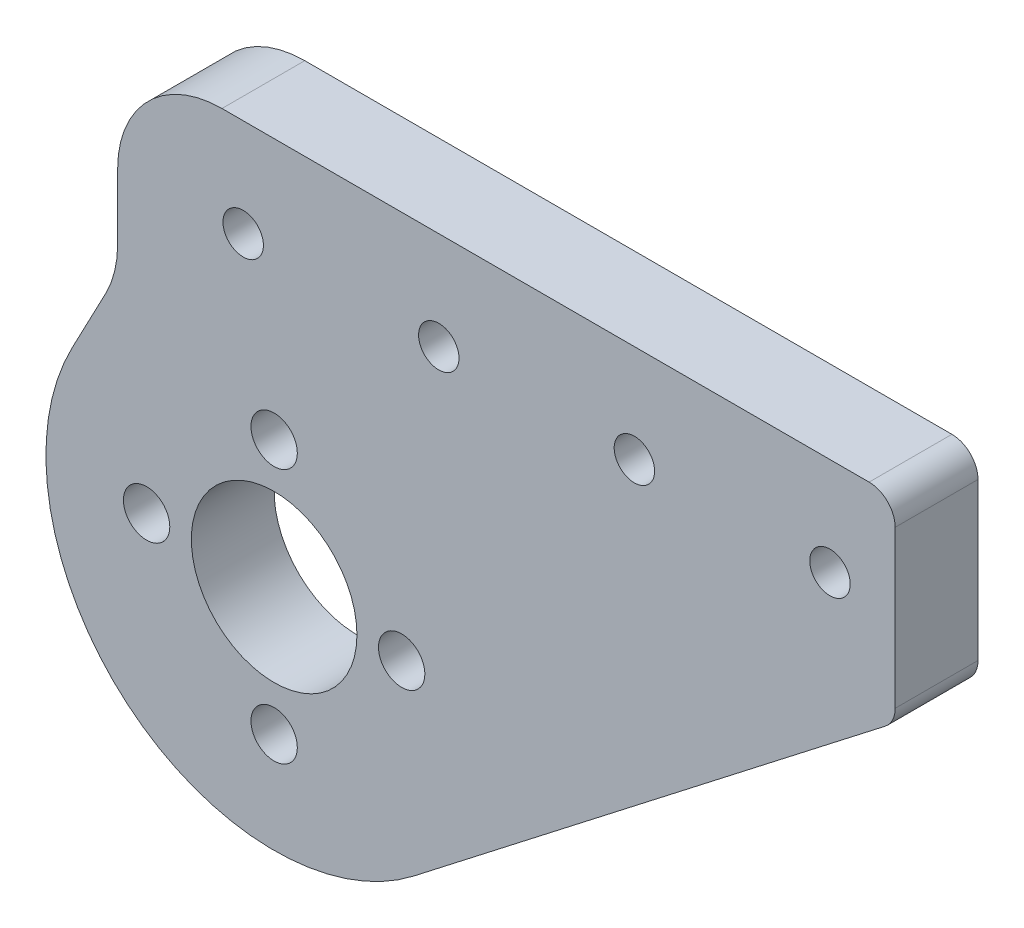
ISO-10303-21;
HEADER;
FILE_DESCRIPTION(('STEP AP214'),'2;1');
FILE_NAME('part.step','',(''),(''),'','','');
FILE_SCHEMA(('AUTOMOTIVE_DESIGN { 1 0 10303 214 1 1 1 1 }'));
ENDSEC;
DATA;
#1=APPLICATION_CONTEXT('core data for automotive mechanical design processes');
#2=APPLICATION_PROTOCOL_DEFINITION('international standard','automotive_design',2000,#1);
#3=PRODUCT_CONTEXT('',#1,'mechanical');
#4=PRODUCT('Part','Part','',(#3));
#5=PRODUCT_RELATED_PRODUCT_CATEGORY('part','',(#4));
#6=PRODUCT_DEFINITION_FORMATION('','',#4);
#7=PRODUCT_DEFINITION_CONTEXT('part definition',#1,'design');
#8=PRODUCT_DEFINITION('design','',#6,#7);
#9=PRODUCT_DEFINITION_SHAPE('','',#8);
#10=(LENGTH_UNIT() NAMED_UNIT(*) SI_UNIT(.MILLI.,.METRE.));
#11=(NAMED_UNIT(*) PLANE_ANGLE_UNIT() SI_UNIT($,.RADIAN.));
#12=(NAMED_UNIT(*) SI_UNIT($,.STERADIAN.) SOLID_ANGLE_UNIT());
#13=UNCERTAINTY_MEASURE_WITH_UNIT(LENGTH_MEASURE(1.E-05),#10,'distance_accuracy_value','');
#14=(GEOMETRIC_REPRESENTATION_CONTEXT(3) GLOBAL_UNCERTAINTY_ASSIGNED_CONTEXT((#13)) GLOBAL_UNIT_ASSIGNED_CONTEXT((#10,
#11,#12)) REPRESENTATION_CONTEXT('',''));
#15=CARTESIAN_POINT('',(0.,0.,0.));
#16=DIRECTION('',(0.,0.,1.));
#17=DIRECTION('',(1.,0.,0.));
#18=AXIS2_PLACEMENT_3D('',#15,#16,#17);
#19=CARTESIAN_POINT('',(-15.4885542715855,8.14583860484291,6.35));
#20=DIRECTION('',(0.885060244090603,-0.465476491705309,0.));
#21=DIRECTION('',(0.465476491705309,0.885060244090603,0.));
#22=AXIS2_PLACEMENT_3D('',#19,#20,#21);
#23=PLANE('',#22);
#24=DIRECTION('',(-0.465476491705309,-0.885060244090603,0.));
#25=VECTOR('',#24,1.);
#26=CARTESIAN_POINT('',(-15.4885542715855,8.14583860484291,6.35));
#27=LINE('',#26,#25);
#28=CARTESIAN_POINT('',(-12.9195180472752,13.0306219790487,6.35));
#29=VERTEX_POINT('',#28);
#30=CARTESIAN_POINT('',(-15.4885542715855,8.14583860484292,6.35));
#31=VERTEX_POINT('',#30);
#32=EDGE_CURVE('E117',#29,#31,#27,.T.);
#33=ORIENTED_EDGE('',*,*,#32,.F.);
#34=DIRECTION('',(0.,0.,-1.));
#35=VECTOR('',#34,1.);
#36=CARTESIAN_POINT('',(-12.9195180472752,13.0306219790487,0.));
#37=LINE('',#36,#35);
#38=CARTESIAN_POINT('',(-12.9195180472752,13.0306219790487,0.));
#39=VERTEX_POINT('',#38);
#40=EDGE_CURVE('E193',#29,#39,#37,.T.);
#41=ORIENTED_EDGE('',*,*,#40,.T.);
#42=DIRECTION('',(-0.465476491705309,-0.885060244090603,0.));
#43=VECTOR('',#42,1.);
#44=CARTESIAN_POINT('',(-15.4885542715855,8.14583860484291,0.));
#45=LINE('',#44,#43);
#46=CARTESIAN_POINT('',(-15.4885542715855,8.14583860484292,0.));
#47=VERTEX_POINT('',#46);
#48=EDGE_CURVE('E142',#39,#47,#45,.T.);
#49=ORIENTED_EDGE('',*,*,#48,.T.);
#50=DIRECTION('',(0.,0.,-1.));
#51=VECTOR('',#50,1.);
#52=CARTESIAN_POINT('',(-15.4885542715855,8.14583860484292,6.35));
#53=LINE('',#52,#51);
#54=EDGE_CURVE('E135',#31,#47,#53,.T.);
#55=ORIENTED_EDGE('',*,*,#54,.F.);
#56=EDGE_LOOP('',(#33,#41,#49,#55));
#57=FACE_BOUND('',#56,.T.);
#58=ADVANCED_FACE('F41',(#57),#23,.F.);
#59=CARTESIAN_POINT('',(0.,0.,6.35));
#60=DIRECTION('',(0.,0.,-1.));
#61=DIRECTION('',(-1.,0.,0.));
#62=AXIS2_PLACEMENT_3D('',#59,#60,#61);
#63=CYLINDRICAL_SURFACE('',#62,17.5);
#64=CARTESIAN_POINT('',(0.,0.,0.));
#65=DIRECTION('',(0.,0.,1.));
#66=DIRECTION('',(1.,0.,0.));
#67=AXIS2_PLACEMENT_3D('',#64,#65,#66);
#68=CIRCLE('',#67,17.5);
#69=CARTESIAN_POINT('',(10.7221171300753,-13.8306255913804,0.));
#70=VERTEX_POINT('',#69);
#71=EDGE_CURVE('E308',#47,#70,#68,.T.);
#72=ORIENTED_EDGE('',*,*,#71,.T.);
#73=DIRECTION('',(0.,0.,-1.));
#74=VECTOR('',#73,1.);
#75=CARTESIAN_POINT('',(10.7221171300753,-13.8306255913804,6.35));
#76=LINE('',#75,#74);
#77=CARTESIAN_POINT('',(10.7221171300753,-13.8306255913804,6.35));
#78=VERTEX_POINT('',#77);
#79=EDGE_CURVE('E137',#78,#70,#76,.T.);
#80=ORIENTED_EDGE('',*,*,#79,.F.);
#81=CARTESIAN_POINT('',(0.,0.,6.35));
#82=DIRECTION('',(0.,0.,1.));
#83=DIRECTION('',(1.,0.,0.));
#84=AXIS2_PLACEMENT_3D('',#81,#82,#83);
#85=CIRCLE('',#84,17.5);
#86=EDGE_CURVE('E122',#31,#78,#85,.T.);
#87=ORIENTED_EDGE('',*,*,#86,.F.);
#88=ORIENTED_EDGE('',*,*,#54,.T.);
#89=EDGE_LOOP('',(#72,#80,#87,#88));
#90=FACE_BOUND('',#89,.T.);
#91=ADVANCED_FACE('F134',(#90),#63,.T.);
#92=CARTESIAN_POINT('',(10.7221171300753,-13.8306255913804,6.35));
#93=DIRECTION('',(0.612692407432875,-0.790321462364593,0.));
#94=DIRECTION('',(0.790321462364593,0.612692407432875,0.));
#95=AXIS2_PLACEMENT_3D('',#92,#93,#94);
#96=PLANE('',#95);
#97=DIRECTION('',(-0.790321462364593,-0.612692407432875,0.));
#98=VECTOR('',#97,1.);
#99=CARTESIAN_POINT('',(10.7221171300753,-13.8306255913804,0.));
#100=LINE('',#99,#98);
#101=CARTESIAN_POINT('',(46.851502811902,14.1784837984104,0.));
#102=VERTEX_POINT('',#101);
#103=EDGE_CURVE('E311',#102,#70,#100,.T.);
#104=ORIENTED_EDGE('',*,*,#103,.F.);
#105=DIRECTION('',(0.,0.,-1.));
#106=VECTOR('',#105,1.);
#107=CARTESIAN_POINT('',(46.851502811902,14.1784837984103,6.35));
#108=LINE('',#107,#106);
#109=CARTESIAN_POINT('',(46.851502811902,14.1784837984104,6.35));
#110=VERTEX_POINT('',#109);
#111=EDGE_CURVE('E164',#102,#110,#108,.F.);
#112=ORIENTED_EDGE('',*,*,#111,.T.);
#113=DIRECTION('',(-0.790321462364593,-0.612692407432875,0.));
#114=VECTOR('',#113,1.);
#115=CARTESIAN_POINT('',(10.7221171300753,-13.8306255913804,6.35));
#116=LINE('',#115,#114);
#117=EDGE_CURVE('E139',#110,#78,#116,.T.);
#118=ORIENTED_EDGE('',*,*,#117,.T.);
#119=ORIENTED_EDGE('',*,*,#79,.T.);
#120=EDGE_LOOP('',(#104,#112,#118,#119));
#121=FACE_BOUND('',#120,.T.);
#122=ADVANCED_FACE('F224',(#121),#96,.T.);
#123=CARTESIAN_POINT('',(47.6261179970363,0.,6.35));
#124=DIRECTION('',(-1.,0.,0.));
#125=DIRECTION('',(0.,-1.,0.));
#126=AXIS2_PLACEMENT_3D('',#123,#124,#125);
#127=PLANE('',#126);
#128=DIRECTION('',(0.,1.,0.));
#129=VECTOR('',#128,1.);
#130=CARTESIAN_POINT('',(47.6261179970363,0.,6.35));
#131=LINE('',#130,#129);
#132=CARTESIAN_POINT('',(47.6261179970363,15.7591267231395,6.35));
#133=VERTEX_POINT('',#132);
#134=CARTESIAN_POINT('',(47.6261179970363,27.779,6.35));
#135=VERTEX_POINT('',#134);
#136=EDGE_CURVE('E257',#133,#135,#131,.T.);
#137=ORIENTED_EDGE('',*,*,#136,.F.);
#138=DIRECTION('',(0.,0.,-1.));
#139=VECTOR('',#138,1.);
#140=CARTESIAN_POINT('',(47.6261179970363,15.7591267231395,0.));
#141=LINE('',#140,#139);
#142=CARTESIAN_POINT('',(47.6261179970363,15.7591267231395,0.));
#143=VERTEX_POINT('',#142);
#144=EDGE_CURVE('E149',#133,#143,#141,.T.);
#145=ORIENTED_EDGE('',*,*,#144,.T.);
#146=DIRECTION('',(0.,1.,0.));
#147=VECTOR('',#146,1.);
#148=CARTESIAN_POINT('',(47.6261179970363,0.,0.));
#149=LINE('',#148,#147);
#150=CARTESIAN_POINT('',(47.6261179970363,27.779,0.));
#151=VERTEX_POINT('',#150);
#152=EDGE_CURVE('E314',#143,#151,#149,.T.);
#153=ORIENTED_EDGE('',*,*,#152,.T.);
#154=DIRECTION('',(0.,0.,-1.));
#155=VECTOR('',#154,1.);
#156=CARTESIAN_POINT('',(47.6261179970363,27.779,6.35));
#157=LINE('',#156,#155);
#158=EDGE_CURVE('E145',#151,#135,#157,.F.);
#159=ORIENTED_EDGE('',*,*,#158,.T.);
#160=EDGE_LOOP('',(#137,#145,#153,#159));
#161=FACE_BOUND('',#160,.T.);
#162=ADVANCED_FACE('F396',(#161),#127,.F.);
#163=CARTESIAN_POINT('',(0.,29.779,6.35));
#164=DIRECTION('',(0.,1.,0.));
#165=DIRECTION('',(0.,0.,1.));
#166=AXIS2_PLACEMENT_3D('',#163,#164,#165);
#167=PLANE('',#166);
#168=DIRECTION('',(1.,0.,0.));
#169=VECTOR('',#168,1.);
#170=CARTESIAN_POINT('',(0.,29.779,0.));
#171=LINE('',#170,#169);
#172=CARTESIAN_POINT('',(-4.,29.779,0.));
#173=VERTEX_POINT('',#172);
#174=CARTESIAN_POINT('',(45.6261179970363,29.779,0.));
#175=VERTEX_POINT('',#174);
#176=EDGE_CURVE('E210',#173,#175,#171,.T.);
#177=ORIENTED_EDGE('',*,*,#176,.F.);
#178=DIRECTION('',(0.,0.,-1.));
#179=VECTOR('',#178,1.);
#180=CARTESIAN_POINT('',(-4.,29.779,6.35));
#181=LINE('',#180,#179);
#182=CARTESIAN_POINT('',(-4.,29.779,6.35));
#183=VERTEX_POINT('',#182);
#184=EDGE_CURVE('E63',#173,#183,#181,.F.);
#185=ORIENTED_EDGE('',*,*,#184,.T.);
#186=DIRECTION('',(1.,0.,0.));
#187=VECTOR('',#186,1.);
#188=CARTESIAN_POINT('',(0.,29.779,6.35));
#189=LINE('',#188,#187);
#190=CARTESIAN_POINT('',(45.6261179970363,29.779,6.35));
#191=VERTEX_POINT('',#190);
#192=EDGE_CURVE('E254',#183,#191,#189,.T.);
#193=ORIENTED_EDGE('',*,*,#192,.T.);
#194=DIRECTION('',(0.,0.,-1.));
#195=VECTOR('',#194,1.);
#196=CARTESIAN_POINT('',(45.6261179970363,29.779,0.));
#197=LINE('',#196,#195);
#198=EDGE_CURVE('E174',#191,#175,#197,.T.);
#199=ORIENTED_EDGE('',*,*,#198,.T.);
#200=EDGE_LOOP('',(#177,#185,#193,#199));
#201=FACE_BOUND('',#200,.T.);
#202=ADVANCED_FACE('F375',(#201),#167,.T.);
#203=CARTESIAN_POINT('',(0.,-9.779,6.35));
#204=DIRECTION('',(0.,0.,-1.));
#205=DIRECTION('',(-1.,0.,0.));
#206=AXIS2_PLACEMENT_3D('',#203,#204,#205);
#207=CYLINDRICAL_SURFACE('',#206,1.778);
#208=CARTESIAN_POINT('',(0.,-9.779,6.35));
#209=DIRECTION('',(0.,0.,1.));
#210=DIRECTION('',(1.,0.,0.));
#211=AXIS2_PLACEMENT_3D('',#208,#209,#210);
#212=CIRCLE('',#211,1.778);
#213=CARTESIAN_POINT('',(1.77799999999993,-9.779,6.35));
#214=VERTEX_POINT('',#213);
#215=EDGE_CURVE('E287',#214,#214,#212,.T.);
#216=ORIENTED_EDGE('',*,*,#215,.T.);
#217=EDGE_LOOP('',(#216));
#218=FACE_BOUND('',#217,.T.);
#219=CARTESIAN_POINT('',(0.,-9.779,0.));
#220=DIRECTION('',(0.,0.,1.));
#221=DIRECTION('',(1.,0.,0.));
#222=AXIS2_PLACEMENT_3D('',#219,#220,#221);
#223=CIRCLE('',#222,1.778);
#224=CARTESIAN_POINT('',(1.77799999999993,-9.779,0.));
#225=VERTEX_POINT('',#224);
#226=EDGE_CURVE('E335',#225,#225,#223,.T.);
#227=ORIENTED_EDGE('',*,*,#226,.F.);
#228=EDGE_LOOP('',(#227));
#229=FACE_BOUND('',#228,.T.);
#230=ADVANCED_FACE('F371',(#218,#229),#207,.F.);
#231=CARTESIAN_POINT('',(42.6261179970363,22.279,6.35));
#232=DIRECTION('',(0.,0.,-1.));
#233=DIRECTION('',(-1.,0.,0.));
#234=AXIS2_PLACEMENT_3D('',#231,#232,#233);
#235=CYLINDRICAL_SURFACE('',#234,1.55);
#236=CARTESIAN_POINT('',(42.6261179970363,22.279,6.35));
#237=DIRECTION('',(0.,0.,1.));
#238=DIRECTION('',(1.,0.,0.));
#239=AXIS2_PLACEMENT_3D('',#236,#237,#238);
#240=CIRCLE('',#239,1.55);
#241=CARTESIAN_POINT('',(44.1761179970363,22.279,6.35));
#242=VERTEX_POINT('',#241);
#243=EDGE_CURVE('E283',#242,#242,#240,.T.);
#244=ORIENTED_EDGE('',*,*,#243,.T.);
#245=EDGE_LOOP('',(#244));
#246=FACE_BOUND('',#245,.T.);
#247=CARTESIAN_POINT('',(42.6261179970363,22.279,0.));
#248=DIRECTION('',(0.,0.,1.));
#249=DIRECTION('',(1.,0.,0.));
#250=AXIS2_PLACEMENT_3D('',#247,#248,#249);
#251=CIRCLE('',#250,1.55);
#252=CARTESIAN_POINT('',(44.1761179970363,22.279,0.));
#253=VERTEX_POINT('',#252);
#254=EDGE_CURVE('E331',#253,#253,#251,.T.);
#255=ORIENTED_EDGE('',*,*,#254,.F.);
#256=EDGE_LOOP('',(#255));
#257=FACE_BOUND('',#256,.T.);
#258=ADVANCED_FACE('F374',(#246,#257),#235,.F.);
#259=CARTESIAN_POINT('',(27.6261179970363,22.279,6.35));
#260=DIRECTION('',(0.,0.,-1.));
#261=DIRECTION('',(-1.,0.,0.));
#262=AXIS2_PLACEMENT_3D('',#259,#260,#261);
#263=CYLINDRICAL_SURFACE('',#262,1.55);
#264=CARTESIAN_POINT('',(27.6261179970363,22.279,6.35));
#265=DIRECTION('',(0.,0.,1.));
#266=DIRECTION('',(1.,0.,0.));
#267=AXIS2_PLACEMENT_3D('',#264,#265,#266);
#268=CIRCLE('',#267,1.55);
#269=CARTESIAN_POINT('',(29.1761179970363,22.279,6.35));
#270=VERTEX_POINT('',#269);
#271=EDGE_CURVE('E279',#270,#270,#268,.T.);
#272=ORIENTED_EDGE('',*,*,#271,.T.);
#273=EDGE_LOOP('',(#272));
#274=FACE_BOUND('',#273,.T.);
#275=CARTESIAN_POINT('',(27.6261179970363,22.279,0.));
#276=DIRECTION('',(0.,0.,1.));
#277=DIRECTION('',(1.,0.,0.));
#278=AXIS2_PLACEMENT_3D('',#275,#276,#277);
#279=CIRCLE('',#278,1.55);
#280=CARTESIAN_POINT('',(29.1761179970363,22.279,0.));
#281=VERTEX_POINT('',#280);
#282=EDGE_CURVE('E327',#281,#281,#279,.T.);
#283=ORIENTED_EDGE('',*,*,#282,.F.);
#284=EDGE_LOOP('',(#283));
#285=FACE_BOUND('',#284,.T.);
#286=ADVANCED_FACE('F379',(#274,#285),#263,.F.);
#287=CARTESIAN_POINT('',(12.6261179970363,22.279,6.35));
#288=DIRECTION('',(0.,0.,-1.));
#289=DIRECTION('',(-1.,0.,0.));
#290=AXIS2_PLACEMENT_3D('',#287,#288,#289);
#291=CYLINDRICAL_SURFACE('',#290,1.55);
#292=CARTESIAN_POINT('',(12.6261179970363,22.279,6.35));
#293=DIRECTION('',(0.,0.,1.));
#294=DIRECTION('',(1.,0.,0.));
#295=AXIS2_PLACEMENT_3D('',#292,#293,#294);
#296=CIRCLE('',#295,1.55);
#297=CARTESIAN_POINT('',(14.1761179970363,22.279,6.35));
#298=VERTEX_POINT('',#297);
#299=EDGE_CURVE('E275',#298,#298,#296,.T.);
#300=ORIENTED_EDGE('',*,*,#299,.T.);
#301=EDGE_LOOP('',(#300));
#302=FACE_BOUND('',#301,.T.);
#303=CARTESIAN_POINT('',(12.6261179970363,22.279,0.));
#304=DIRECTION('',(0.,0.,1.));
#305=DIRECTION('',(1.,0.,0.));
#306=AXIS2_PLACEMENT_3D('',#303,#304,#305);
#307=CIRCLE('',#306,1.55);
#308=CARTESIAN_POINT('',(14.1761179970363,22.279,0.));
#309=VERTEX_POINT('',#308);
#310=EDGE_CURVE('E323',#309,#309,#307,.T.);
#311=ORIENTED_EDGE('',*,*,#310,.F.);
#312=EDGE_LOOP('',(#311));
#313=FACE_BOUND('',#312,.T.);
#314=ADVANCED_FACE('F383',(#302,#313),#291,.F.);
#315=CARTESIAN_POINT('',(-2.37388200296373,22.279,6.35));
#316=DIRECTION('',(0.,0.,-1.));
#317=DIRECTION('',(-1.,0.,0.));
#318=AXIS2_PLACEMENT_3D('',#315,#316,#317);
#319=CYLINDRICAL_SURFACE('',#318,1.55);
#320=CARTESIAN_POINT('',(-2.37388200296373,22.279,6.35));
#321=DIRECTION('',(0.,0.,1.));
#322=DIRECTION('',(1.,0.,0.));
#323=AXIS2_PLACEMENT_3D('',#320,#321,#322);
#324=CIRCLE('',#323,1.55);
#325=CARTESIAN_POINT('',(-0.823882002963734,22.279,6.35));
#326=VERTEX_POINT('',#325);
#327=EDGE_CURVE('E271',#326,#326,#324,.T.);
#328=ORIENTED_EDGE('',*,*,#327,.T.);
#329=EDGE_LOOP('',(#328));
#330=FACE_BOUND('',#329,.T.);
#331=CARTESIAN_POINT('',(-2.37388200296373,22.279,0.));
#332=DIRECTION('',(0.,0.,1.));
#333=DIRECTION('',(1.,0.,0.));
#334=AXIS2_PLACEMENT_3D('',#331,#332,#333);
#335=CIRCLE('',#334,1.55);
#336=CARTESIAN_POINT('',(-0.823882002963734,22.279,0.));
#337=VERTEX_POINT('',#336);
#338=EDGE_CURVE('E209',#337,#337,#335,.T.);
#339=ORIENTED_EDGE('',*,*,#338,.F.);
#340=EDGE_LOOP('',(#339));
#341=FACE_BOUND('',#340,.T.);
#342=ADVANCED_FACE('F387',(#330,#341),#319,.F.);
#343=CARTESIAN_POINT('',(-12.,0.,6.35));
#344=DIRECTION('',(1.,0.,0.));
#345=DIRECTION('',(0.,1.,0.));
#346=AXIS2_PLACEMENT_3D('',#343,#344,#345);
#347=PLANE('',#346);
#348=DIRECTION('',(0.,-1.,0.));
#349=VECTOR('',#348,1.);
#350=CARTESIAN_POINT('',(-12.,0.,6.35));
#351=LINE('',#350,#349);
#352=CARTESIAN_POINT('',(-12.,21.779,6.35));
#353=VERTEX_POINT('',#352);
#354=CARTESIAN_POINT('',(-12.,16.7544339126912,6.35));
#355=VERTEX_POINT('',#354);
#356=EDGE_CURVE('E265',#353,#355,#351,.T.);
#357=ORIENTED_EDGE('',*,*,#356,.F.);
#358=DIRECTION('',(0.,0.,-1.));
#359=VECTOR('',#358,1.);
#360=CARTESIAN_POINT('',(-12.,21.779,0.));
#361=LINE('',#360,#359);
#362=CARTESIAN_POINT('',(-12.,21.779,0.));
#363=VERTEX_POINT('',#362);
#364=EDGE_CURVE('E181',#353,#363,#361,.T.);
#365=ORIENTED_EDGE('',*,*,#364,.T.);
#366=DIRECTION('',(0.,-1.,0.));
#367=VECTOR('',#366,1.);
#368=CARTESIAN_POINT('',(-12.,0.,0.));
#369=LINE('',#368,#367);
#370=CARTESIAN_POINT('',(-12.,16.7544339126912,0.));
#371=VERTEX_POINT('',#370);
#372=EDGE_CURVE('E201',#363,#371,#369,.T.);
#373=ORIENTED_EDGE('',*,*,#372,.T.);
#374=DIRECTION('',(0.,0.,-1.));
#375=VECTOR('',#374,1.);
#376=CARTESIAN_POINT('',(-12.,16.7544339126912,6.35));
#377=LINE('',#376,#375);
#378=EDGE_CURVE('E178',#371,#355,#377,.F.);
#379=ORIENTED_EDGE('',*,*,#378,.T.);
#380=EDGE_LOOP('',(#357,#365,#373,#379));
#381=FACE_BOUND('',#380,.T.);
#382=ADVANCED_FACE('F206',(#381),#347,.F.);
#383=CARTESIAN_POINT('',(9.779,0.,6.35));
#384=DIRECTION('',(0.,0.,-1.));
#385=DIRECTION('',(-1.,0.,0.));
#386=AXIS2_PLACEMENT_3D('',#383,#384,#385);
#387=CYLINDRICAL_SURFACE('',#386,1.778);
#388=CARTESIAN_POINT('',(9.779,0.,6.35));
#389=DIRECTION('',(0.,0.,1.));
#390=DIRECTION('',(1.,0.,0.));
#391=AXIS2_PLACEMENT_3D('',#388,#389,#390);
#392=CIRCLE('',#391,1.778);
#393=CARTESIAN_POINT('',(11.557,0.,6.35));
#394=VERTEX_POINT('',#393);
#395=EDGE_CURVE('E129',#394,#394,#392,.T.);
#396=ORIENTED_EDGE('',*,*,#395,.T.);
#397=EDGE_LOOP('',(#396));
#398=FACE_BOUND('',#397,.T.);
#399=CARTESIAN_POINT('',(9.779,0.,0.));
#400=DIRECTION('',(0.,0.,1.));
#401=DIRECTION('',(1.,0.,0.));
#402=AXIS2_PLACEMENT_3D('',#399,#400,#401);
#403=CIRCLE('',#402,1.778);
#404=CARTESIAN_POINT('',(11.557,0.,0.));
#405=VERTEX_POINT('',#404);
#406=EDGE_CURVE('E302',#405,#405,#403,.T.);
#407=ORIENTED_EDGE('',*,*,#406,.F.);
#408=EDGE_LOOP('',(#407));
#409=FACE_BOUND('',#408,.T.);
#410=ADVANCED_FACE('F228',(#398,#409),#387,.F.);
#411=CARTESIAN_POINT('',(0.,9.779,6.35));
#412=DIRECTION('',(0.,0.,-1.));
#413=DIRECTION('',(-1.,0.,0.));
#414=AXIS2_PLACEMENT_3D('',#411,#412,#413);
#415=CYLINDRICAL_SURFACE('',#414,1.778);
#416=CARTESIAN_POINT('',(0.,9.779,6.35));
#417=DIRECTION('',(0.,0.,1.));
#418=DIRECTION('',(1.,0.,0.));
#419=AXIS2_PLACEMENT_3D('',#416,#417,#418);
#420=CIRCLE('',#419,1.778);
#421=CARTESIAN_POINT('',(1.778,9.779,6.35));
#422=VERTEX_POINT('',#421);
#423=EDGE_CURVE('E346',#422,#422,#420,.T.);
#424=ORIENTED_EDGE('',*,*,#423,.T.);
#425=EDGE_LOOP('',(#424));
#426=FACE_BOUND('',#425,.T.);
#427=CARTESIAN_POINT('',(0.,9.779,0.));
#428=DIRECTION('',(0.,0.,1.));
#429=DIRECTION('',(1.,0.,0.));
#430=AXIS2_PLACEMENT_3D('',#427,#428,#429);
#431=CIRCLE('',#430,1.778);
#432=CARTESIAN_POINT('',(1.778,9.779,0.));
#433=VERTEX_POINT('',#432);
#434=EDGE_CURVE('E298',#433,#433,#431,.T.);
#435=ORIENTED_EDGE('',*,*,#434,.F.);
#436=EDGE_LOOP('',(#435));
#437=FACE_BOUND('',#436,.T.);
#438=ADVANCED_FACE('F231',(#426,#437),#415,.F.);
#439=CARTESIAN_POINT('',(-9.779,1.02429588037641E-13,6.35));
#440=DIRECTION('',(0.,0.,-1.));
#441=DIRECTION('',(-1.,0.,0.));
#442=AXIS2_PLACEMENT_3D('',#439,#440,#441);
#443=CYLINDRICAL_SURFACE('',#442,1.778);
#444=CARTESIAN_POINT('',(-9.779,1.02429588037641E-13,6.35));
#445=DIRECTION('',(0.,0.,1.));
#446=DIRECTION('',(1.,0.,0.));
#447=AXIS2_PLACEMENT_3D('',#444,#445,#446);
#448=CIRCLE('',#447,1.778);
#449=CARTESIAN_POINT('',(-8.001,1.02429588037641E-13,6.35));
#450=VERTEX_POINT('',#449);
#451=EDGE_CURVE('E341',#450,#450,#448,.T.);
#452=ORIENTED_EDGE('',*,*,#451,.T.);
#453=EDGE_LOOP('',(#452));
#454=FACE_BOUND('',#453,.T.);
#455=CARTESIAN_POINT('',(-9.779,1.02429588037641E-13,0.));
#456=DIRECTION('',(0.,0.,1.));
#457=DIRECTION('',(1.,0.,0.));
#458=AXIS2_PLACEMENT_3D('',#455,#456,#457);
#459=CIRCLE('',#458,1.778);
#460=CARTESIAN_POINT('',(-8.001,1.02429588037641E-13,0.));
#461=VERTEX_POINT('',#460);
#462=EDGE_CURVE('E294',#461,#461,#459,.T.);
#463=ORIENTED_EDGE('',*,*,#462,.F.);
#464=EDGE_LOOP('',(#463));
#465=FACE_BOUND('',#464,.T.);
#466=ADVANCED_FACE('F235',(#454,#465),#443,.F.);
#467=CARTESIAN_POINT('',(0.,0.,6.35));
#468=DIRECTION('',(0.,0.,-1.));
#469=DIRECTION('',(-1.,0.,0.));
#470=AXIS2_PLACEMENT_3D('',#467,#468,#469);
#471=CYLINDRICAL_SURFACE('',#470,6.35);
#472=CARTESIAN_POINT('',(0.,0.,6.35));
#473=DIRECTION('',(0.,0.,1.));
#474=DIRECTION('',(1.,0.,0.));
#475=AXIS2_PLACEMENT_3D('',#472,#473,#474);
#476=CIRCLE('',#475,6.35);
#477=CARTESIAN_POINT('',(6.35,0.,6.35));
#478=VERTEX_POINT('',#477);
#479=EDGE_CURVE('E151',#478,#478,#476,.T.);
#480=ORIENTED_EDGE('',*,*,#479,.T.);
#481=EDGE_LOOP('',(#480));
#482=FACE_BOUND('',#481,.T.);
#483=CARTESIAN_POINT('',(0.,0.,0.));
#484=DIRECTION('',(0.,0.,1.));
#485=DIRECTION('',(1.,0.,0.));
#486=AXIS2_PLACEMENT_3D('',#483,#484,#485);
#487=CIRCLE('',#486,6.35);
#488=CARTESIAN_POINT('',(6.35,0.,0.));
#489=VERTEX_POINT('',#488);
#490=EDGE_CURVE('E338',#489,#489,#487,.T.);
#491=ORIENTED_EDGE('',*,*,#490,.F.);
#492=EDGE_LOOP('',(#491));
#493=FACE_BOUND('',#492,.T.);
#494=ADVANCED_FACE('F239',(#482,#493),#471,.F.);
#495=CARTESIAN_POINT('',(0.,0.,6.35));
#496=DIRECTION('',(0.,0.,1.));
#497=DIRECTION('',(1.,0.,0.));
#498=AXIS2_PLACEMENT_3D('',#495,#496,#497);
#499=PLANE('',#498);
#500=ORIENTED_EDGE('',*,*,#451,.F.);
#501=EDGE_LOOP('',(#500));
#502=FACE_BOUND('',#501,.T.);
#503=ORIENTED_EDGE('',*,*,#423,.F.);
#504=EDGE_LOOP('',(#503));
#505=FACE_BOUND('',#504,.T.);
#506=ORIENTED_EDGE('',*,*,#395,.F.);
#507=EDGE_LOOP('',(#506));
#508=FACE_BOUND('',#507,.T.);
#509=ORIENTED_EDGE('',*,*,#192,.F.);
#510=CARTESIAN_POINT('',(-4.,21.779,6.35));
#511=DIRECTION('',(0.,0.,1.));
#512=DIRECTION('',(1.,0.,0.));
#513=AXIS2_PLACEMENT_3D('',#510,#511,#512);
#514=CIRCLE('',#513,8.);
#515=EDGE_CURVE('E190',#183,#353,#514,.T.);
#516=ORIENTED_EDGE('',*,*,#515,.T.);
#517=ORIENTED_EDGE('',*,*,#356,.T.);
#518=CARTESIAN_POINT('',(-20.,16.7544339126912,6.35));
#519=DIRECTION('',(0.,0.,1.));
#520=DIRECTION('',(1.,0.,0.));
#521=AXIS2_PLACEMENT_3D('',#518,#519,#520);
#522=CIRCLE('',#521,8.);
#523=EDGE_CURVE('E11',#355,#29,#522,.F.);
#524=ORIENTED_EDGE('',*,*,#523,.T.);
#525=ORIENTED_EDGE('',*,*,#32,.T.);
#526=ORIENTED_EDGE('',*,*,#86,.T.);
#527=ORIENTED_EDGE('',*,*,#117,.F.);
#528=CARTESIAN_POINT('',(45.6261179970363,15.7591267231395,6.35));
#529=DIRECTION('',(0.,0.,1.));
#530=DIRECTION('',(1.,0.,0.));
#531=AXIS2_PLACEMENT_3D('',#528,#529,#530);
#532=CIRCLE('',#531,2.);
#533=EDGE_CURVE('E171',#110,#133,#532,.T.);
#534=ORIENTED_EDGE('',*,*,#533,.T.);
#535=ORIENTED_EDGE('',*,*,#136,.T.);
#536=CARTESIAN_POINT('',(45.6261179970363,27.779,6.35));
#537=DIRECTION('',(0.,0.,1.));
#538=DIRECTION('',(1.,0.,0.));
#539=AXIS2_PLACEMENT_3D('',#536,#537,#538);
#540=CIRCLE('',#539,2.);
#541=EDGE_CURVE('E167',#135,#191,#540,.T.);
#542=ORIENTED_EDGE('',*,*,#541,.T.);
#543=EDGE_LOOP('',(#509,#516,#517,#524,#525,#526,#527,#534,#535,#542));
#544=FACE_BOUND('',#543,.T.);
#545=ORIENTED_EDGE('',*,*,#327,.F.);
#546=EDGE_LOOP('',(#545));
#547=FACE_BOUND('',#546,.T.);
#548=ORIENTED_EDGE('',*,*,#299,.F.);
#549=EDGE_LOOP('',(#548));
#550=FACE_BOUND('',#549,.T.);
#551=ORIENTED_EDGE('',*,*,#271,.F.);
#552=EDGE_LOOP('',(#551));
#553=FACE_BOUND('',#552,.T.);
#554=ORIENTED_EDGE('',*,*,#243,.F.);
#555=EDGE_LOOP('',(#554));
#556=FACE_BOUND('',#555,.T.);
#557=ORIENTED_EDGE('',*,*,#215,.F.);
#558=EDGE_LOOP('',(#557));
#559=FACE_BOUND('',#558,.T.);
#560=ORIENTED_EDGE('',*,*,#479,.F.);
#561=EDGE_LOOP('',(#560));
#562=FACE_BOUND('',#561,.T.);
#563=ADVANCED_FACE('F119',(#502,#505,#508,#544,#547,#550,#553,#556,#559,#562),#499,.T.);
#564=CARTESIAN_POINT('',(0.,0.,0.));
#565=DIRECTION('',(0.,0.,1.));
#566=DIRECTION('',(1.,0.,0.));
#567=AXIS2_PLACEMENT_3D('',#564,#565,#566);
#568=PLANE('',#567);
#569=ORIENTED_EDGE('',*,*,#462,.T.);
#570=EDGE_LOOP('',(#569));
#571=FACE_BOUND('',#570,.T.);
#572=ORIENTED_EDGE('',*,*,#434,.T.);
#573=EDGE_LOOP('',(#572));
#574=FACE_BOUND('',#573,.T.);
#575=ORIENTED_EDGE('',*,*,#406,.T.);
#576=EDGE_LOOP('',(#575));
#577=FACE_BOUND('',#576,.T.);
#578=ORIENTED_EDGE('',*,*,#372,.F.);
#579=CARTESIAN_POINT('',(-4.,21.779,0.));
#580=DIRECTION('',(0.,0.,1.));
#581=DIRECTION('',(1.,0.,0.));
#582=AXIS2_PLACEMENT_3D('',#579,#580,#581);
#583=CIRCLE('',#582,8.);
#584=EDGE_CURVE('E185',#363,#173,#583,.F.);
#585=ORIENTED_EDGE('',*,*,#584,.T.);
#586=ORIENTED_EDGE('',*,*,#176,.T.);
#587=CARTESIAN_POINT('',(45.6261179970363,27.779,0.));
#588=DIRECTION('',(0.,0.,1.));
#589=DIRECTION('',(1.,0.,0.));
#590=AXIS2_PLACEMENT_3D('',#587,#588,#589);
#591=CIRCLE('',#590,2.);
#592=EDGE_CURVE('E158',#175,#151,#591,.F.);
#593=ORIENTED_EDGE('',*,*,#592,.T.);
#594=ORIENTED_EDGE('',*,*,#152,.F.);
#595=CARTESIAN_POINT('',(45.6261179970363,15.7591267231395,0.));
#596=DIRECTION('',(0.,0.,1.));
#597=DIRECTION('',(1.,0.,0.));
#598=AXIS2_PLACEMENT_3D('',#595,#596,#597);
#599=CIRCLE('',#598,2.);
#600=EDGE_CURVE('E161',#143,#102,#599,.F.);
#601=ORIENTED_EDGE('',*,*,#600,.T.);
#602=ORIENTED_EDGE('',*,*,#103,.T.);
#603=ORIENTED_EDGE('',*,*,#71,.F.);
#604=ORIENTED_EDGE('',*,*,#48,.F.);
#605=CARTESIAN_POINT('',(-20.,16.7544339126912,0.));
#606=DIRECTION('',(0.,0.,1.));
#607=DIRECTION('',(1.,0.,0.));
#608=AXIS2_PLACEMENT_3D('',#605,#606,#607);
#609=CIRCLE('',#608,8.);
#610=EDGE_CURVE('E50',#39,#371,#609,.T.);
#611=ORIENTED_EDGE('',*,*,#610,.T.);
#612=EDGE_LOOP('',(#578,#585,#586,#593,#594,#601,#602,#603,#604,#611));
#613=FACE_BOUND('',#612,.T.);
#614=ORIENTED_EDGE('',*,*,#338,.T.);
#615=EDGE_LOOP('',(#614));
#616=FACE_BOUND('',#615,.T.);
#617=ORIENTED_EDGE('',*,*,#310,.T.);
#618=EDGE_LOOP('',(#617));
#619=FACE_BOUND('',#618,.T.);
#620=ORIENTED_EDGE('',*,*,#282,.T.);
#621=EDGE_LOOP('',(#620));
#622=FACE_BOUND('',#621,.T.);
#623=ORIENTED_EDGE('',*,*,#254,.T.);
#624=EDGE_LOOP('',(#623));
#625=FACE_BOUND('',#624,.T.);
#626=ORIENTED_EDGE('',*,*,#226,.T.);
#627=EDGE_LOOP('',(#626));
#628=FACE_BOUND('',#627,.T.);
#629=ORIENTED_EDGE('',*,*,#490,.T.);
#630=EDGE_LOOP('',(#629));
#631=FACE_BOUND('',#630,.T.);
#632=ADVANCED_FACE('F199',(#571,#574,#577,#613,#616,#619,#622,#625,#628,#631),#568,.F.);
#633=CARTESIAN_POINT('',(45.6261179970363,15.7591267231395,6.35));
#634=DIRECTION('',(0.,0.,1.));
#635=DIRECTION('',(1.,0.,0.));
#636=AXIS2_PLACEMENT_3D('',#633,#634,#635);
#637=CYLINDRICAL_SURFACE('',#636,2.);
#638=ORIENTED_EDGE('',*,*,#533,.F.);
#639=ORIENTED_EDGE('',*,*,#111,.F.);
#640=ORIENTED_EDGE('',*,*,#600,.F.);
#641=ORIENTED_EDGE('',*,*,#144,.F.);
#642=EDGE_LOOP('',(#638,#639,#640,#641));
#643=FACE_BOUND('',#642,.T.);
#644=ADVANCED_FACE('F241',(#643),#637,.T.);
#645=CARTESIAN_POINT('',(45.6261179970363,27.779,6.35));
#646=DIRECTION('',(0.,0.,1.));
#647=DIRECTION('',(1.,0.,0.));
#648=AXIS2_PLACEMENT_3D('',#645,#646,#647);
#649=CYLINDRICAL_SURFACE('',#648,2.);
#650=ORIENTED_EDGE('',*,*,#541,.F.);
#651=ORIENTED_EDGE('',*,*,#158,.F.);
#652=ORIENTED_EDGE('',*,*,#592,.F.);
#653=ORIENTED_EDGE('',*,*,#198,.F.);
#654=EDGE_LOOP('',(#650,#651,#652,#653));
#655=FACE_BOUND('',#654,.T.);
#656=ADVANCED_FACE('F217',(#655),#649,.T.);
#657=CARTESIAN_POINT('',(-4.,21.779,6.35));
#658=DIRECTION('',(0.,0.,1.));
#659=DIRECTION('',(1.,0.,0.));
#660=AXIS2_PLACEMENT_3D('',#657,#658,#659);
#661=CYLINDRICAL_SURFACE('',#660,8.);
#662=ORIENTED_EDGE('',*,*,#515,.F.);
#663=ORIENTED_EDGE('',*,*,#184,.F.);
#664=ORIENTED_EDGE('',*,*,#584,.F.);
#665=ORIENTED_EDGE('',*,*,#364,.F.);
#666=EDGE_LOOP('',(#662,#663,#664,#665));
#667=FACE_BOUND('',#666,.T.);
#668=ADVANCED_FACE('F213',(#667),#661,.T.);
#669=CARTESIAN_POINT('',(-20.,16.7544339126912,6.35));
#670=DIRECTION('',(0.,0.,1.));
#671=DIRECTION('',(1.,0.,0.));
#672=AXIS2_PLACEMENT_3D('',#669,#670,#671);
#673=CYLINDRICAL_SURFACE('',#672,8.);
#674=ORIENTED_EDGE('',*,*,#523,.F.);
#675=ORIENTED_EDGE('',*,*,#378,.F.);
#676=ORIENTED_EDGE('',*,*,#610,.F.);
#677=ORIENTED_EDGE('',*,*,#40,.F.);
#678=EDGE_LOOP('',(#674,#675,#676,#677));
#679=FACE_BOUND('',#678,.T.);
#680=ADVANCED_FACE('F43',(#679),#673,.F.);
#681=CLOSED_SHELL('',(#58,#91,#122,#162,#202,#230,#258,#286,#314,#342,#382,#410,#438,#466,#494,
#563,#632,#644,#656,#668,#680));
#682=MANIFOLD_SOLID_BREP('B2',#681);
#683=ADVANCED_BREP_SHAPE_REPRESENTATION('',(#18,#682),#14);
#684=SHAPE_DEFINITION_REPRESENTATION(#9,#683);
ENDSEC;
END-ISO-10303-21;
